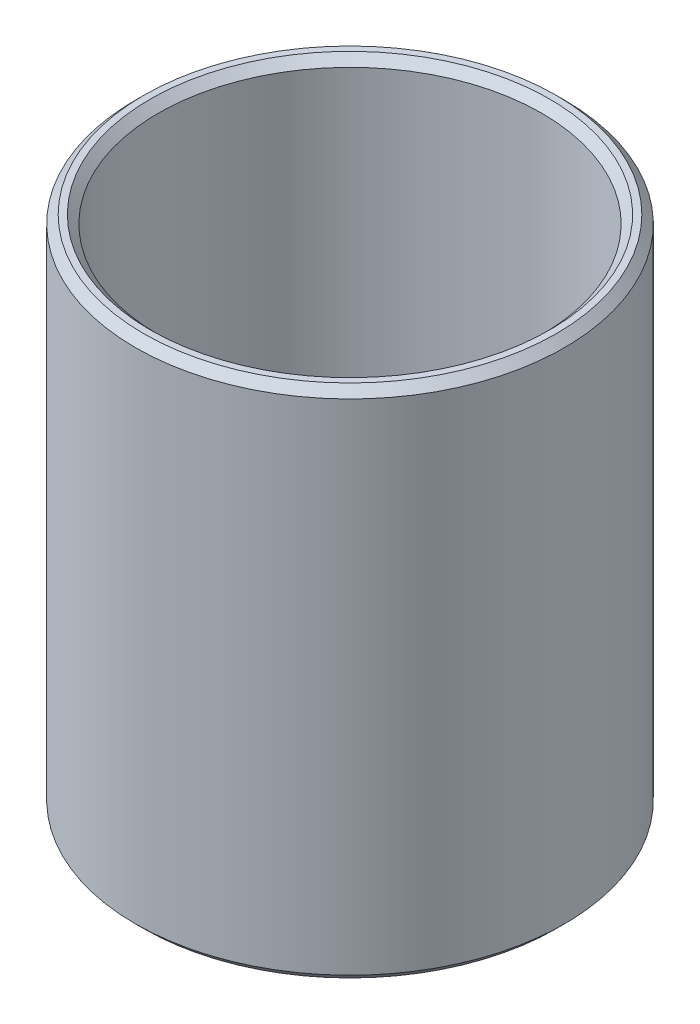
ISO-10303-21;
HEADER;
FILE_DESCRIPTION(('STEP AP214'),'2;1');
FILE_NAME('part.step','',(''),(''),'','','');
FILE_SCHEMA(('AUTOMOTIVE_DESIGN { 1 0 10303 214 1 1 1 1 }'));
ENDSEC;
DATA;
#1=APPLICATION_CONTEXT('core data for automotive mechanical design processes');
#2=APPLICATION_PROTOCOL_DEFINITION('international standard','automotive_design',2000,#1);
#3=PRODUCT_CONTEXT('',#1,'mechanical');
#4=PRODUCT('Part','Part','',(#3));
#5=PRODUCT_RELATED_PRODUCT_CATEGORY('part','',(#4));
#6=PRODUCT_DEFINITION_FORMATION('','',#4);
#7=PRODUCT_DEFINITION_CONTEXT('part definition',#1,'design');
#8=PRODUCT_DEFINITION('design','',#6,#7);
#9=PRODUCT_DEFINITION_SHAPE('','',#8);
#10=(LENGTH_UNIT() NAMED_UNIT(*) SI_UNIT(.MILLI.,.METRE.));
#11=(NAMED_UNIT(*) PLANE_ANGLE_UNIT() SI_UNIT($,.RADIAN.));
#12=(NAMED_UNIT(*) SI_UNIT($,.STERADIAN.) SOLID_ANGLE_UNIT());
#13=UNCERTAINTY_MEASURE_WITH_UNIT(LENGTH_MEASURE(1.E-05),#10,'distance_accuracy_value','');
#14=(GEOMETRIC_REPRESENTATION_CONTEXT(3) GLOBAL_UNCERTAINTY_ASSIGNED_CONTEXT((#13)) GLOBAL_UNIT_ASSIGNED_CONTEXT((#10,
#11,#12)) REPRESENTATION_CONTEXT('',''));
#15=CARTESIAN_POINT('',(0.,0.,0.));
#16=DIRECTION('',(0.,0.,1.));
#17=DIRECTION('',(1.,0.,0.));
#18=AXIS2_PLACEMENT_3D('',#15,#16,#17);
#19=CARTESIAN_POINT('',(0.,102.10385345055,0.));
#20=DIRECTION('',(0.,-1.,0.));
#21=DIRECTION('',(0.,0.,-1.));
#22=AXIS2_PLACEMENT_3D('',#19,#20,#21);
#23=CYLINDRICAL_SURFACE('',#22,42.5);
#24=CARTESIAN_POINT('',(0.,1.60744436866984,0.));
#25=DIRECTION('',(0.,1.,0.));
#26=DIRECTION('',(0.,0.,1.));
#27=AXIS2_PLACEMENT_3D('',#24,#25,#26);
#28=CIRCLE('',#27,42.5);
#29=CARTESIAN_POINT('',(0.,1.60744436866984,42.5));
#30=VERTEX_POINT('',#29);
#31=EDGE_CURVE('E10',#30,#30,#28,.T.);
#32=ORIENTED_EDGE('',*,*,#31,.T.);
#33=EDGE_LOOP('',(#32));
#34=FACE_BOUND('',#33,.T.);
#35=CARTESIAN_POINT('',(0.,100.496409081881,0.));
#36=DIRECTION('',(0.,1.,0.));
#37=DIRECTION('',(0.,0.,1.));
#38=AXIS2_PLACEMENT_3D('',#35,#36,#37);
#39=CIRCLE('',#38,42.5);
#40=CARTESIAN_POINT('',(0.,100.496409081881,42.5));
#41=VERTEX_POINT('',#40);
#42=EDGE_CURVE('E50',#41,#41,#39,.F.);
#43=ORIENTED_EDGE('',*,*,#42,.T.);
#44=EDGE_LOOP('',(#43));
#45=FACE_BOUND('',#44,.T.);
#46=ADVANCED_FACE('F39',(#34,#45),#23,.T.);
#47=CARTESIAN_POINT('',(0.,102.10385345055,0.));
#48=DIRECTION('',(0.,1.,0.));
#49=DIRECTION('',(0.,0.,1.));
#50=AXIS2_PLACEMENT_3D('',#47,#48,#49);
#51=PLANE('',#50);
#52=CARTESIAN_POINT('',(0.,102.10385345055,0.));
#53=DIRECTION('',(0.,1.,0.));
#54=DIRECTION('',(0.,0.,1.));
#55=AXIS2_PLACEMENT_3D('',#52,#53,#54);
#56=CIRCLE('',#55,39.6003826100809);
#57=CARTESIAN_POINT('',(0.,102.10385345055,39.6003826100809));
#58=VERTEX_POINT('',#57);
#59=EDGE_CURVE('E58',#58,#58,#56,.F.);
#60=ORIENTED_EDGE('',*,*,#59,.T.);
#61=EDGE_LOOP('',(#60));
#62=FACE_BOUND('',#61,.T.);
#63=CARTESIAN_POINT('',(0.,102.10385345055,0.));
#64=DIRECTION('',(0.,1.,0.));
#65=DIRECTION('',(0.,0.,1.));
#66=AXIS2_PLACEMENT_3D('',#63,#64,#65);
#67=CIRCLE('',#66,40.8925556313302);
#68=CARTESIAN_POINT('',(0.,102.10385345055,40.8925556313302));
#69=VERTEX_POINT('',#68);
#70=EDGE_CURVE('E61',#69,#69,#67,.T.);
#71=ORIENTED_EDGE('',*,*,#70,.T.);
#72=EDGE_LOOP('',(#71));
#73=FACE_BOUND('',#72,.T.);
#74=ADVANCED_FACE('F88',(#62,#73),#51,.T.);
#75=CARTESIAN_POINT('',(0.,0.,0.));
#76=DIRECTION('',(0.,1.,0.));
#77=DIRECTION('',(0.,0.,1.));
#78=AXIS2_PLACEMENT_3D('',#75,#76,#77);
#79=PLANE('',#78);
#80=CARTESIAN_POINT('',(0.,0.,0.));
#81=DIRECTION('',(0.,1.,0.));
#82=DIRECTION('',(0.,0.,1.));
#83=AXIS2_PLACEMENT_3D('',#80,#81,#82);
#84=CIRCLE('',#83,39.6003826100809);
#85=CARTESIAN_POINT('',(0.,0.,-39.6003826100809));
#86=VERTEX_POINT('',#85);
#87=EDGE_CURVE('E51',#86,#86,#84,.T.);
#88=ORIENTED_EDGE('',*,*,#87,.T.);
#89=EDGE_LOOP('',(#88));
#90=FACE_BOUND('',#89,.T.);
#91=CARTESIAN_POINT('',(0.,0.,0.));
#92=DIRECTION('',(0.,1.,0.));
#93=DIRECTION('',(0.,0.,1.));
#94=AXIS2_PLACEMENT_3D('',#91,#92,#93);
#95=CIRCLE('',#94,40.8925556313302);
#96=CARTESIAN_POINT('',(0.,0.,40.8925556313302));
#97=VERTEX_POINT('',#96);
#98=EDGE_CURVE('E54',#97,#97,#95,.F.);
#99=ORIENTED_EDGE('',*,*,#98,.T.);
#100=EDGE_LOOP('',(#99));
#101=FACE_BOUND('',#100,.T.);
#102=ADVANCED_FACE('F83',(#90,#101),#79,.F.);
#103=CARTESIAN_POINT('',(0.,102.10385345055,0.));
#104=DIRECTION('',(0.,-1.,0.));
#105=DIRECTION('',(0.,0.,-1.));
#106=AXIS2_PLACEMENT_3D('',#103,#104,#105);
#107=CYLINDRICAL_SURFACE('',#106,37.9929382414111);
#108=CARTESIAN_POINT('',(0.,100.496409081881,0.));
#109=DIRECTION('',(0.,1.,0.));
#110=DIRECTION('',(0.,0.,1.));
#111=AXIS2_PLACEMENT_3D('',#108,#109,#110);
#112=CIRCLE('',#111,37.9929382414111);
#113=CARTESIAN_POINT('',(0.,100.496409081881,-37.9929382414111));
#114=VERTEX_POINT('',#113);
#115=EDGE_CURVE('E67',#114,#114,#112,.T.);
#116=CARTESIAN_POINT('',(0.,1.60744436866984,0.));
#117=DIRECTION('',(0.,1.,0.));
#118=DIRECTION('',(0.,0.,1.));
#119=AXIS2_PLACEMENT_3D('',#116,#117,#118);
#120=CIRCLE('',#119,37.9929382414111);
#121=CARTESIAN_POINT('',(0.,1.60744436866984,-37.9929382414111));
#122=VERTEX_POINT('',#121);
#123=EDGE_CURVE('E69',#122,#122,#120,.F.);
#124=CARTESIAN_POINT('',(0.,100.496409081881,-37.9929382414111));
#125=CARTESIAN_POINT('',(0.,99.4663156994513,-37.9929382414111));
#126=CARTESIAN_POINT('',(0.,98.436222317022,-37.9929382414111));
#127=CARTESIAN_POINT('',(0.,96.3760355521634,-37.9929382414111));
#128=CARTESIAN_POINT('',(0.,95.3459421697341,-37.9929382414111));
#129=CARTESIAN_POINT('',(0.,93.2857554048756,-37.9929382414111));
#130=CARTESIAN_POINT('',(0.,92.2556620224463,-37.9929382414111));
#131=CARTESIAN_POINT('',(0.,90.1954752575878,-37.9929382414111));
#132=CARTESIAN_POINT('',(0.,89.1653818751585,-37.9929382414111));
#133=CARTESIAN_POINT('',(0.,87.1051951102999,-37.9929382414111));
#134=CARTESIAN_POINT('',(0.,86.0751017278706,-37.9929382414111));
#135=CARTESIAN_POINT('',(0.,84.0149149630121,-37.9929382414111));
#136=CARTESIAN_POINT('',(0.,82.9848215805828,-37.9929382414111));
#137=CARTESIAN_POINT('',(0.,80.9246348157242,-37.9929382414111));
#138=CARTESIAN_POINT('',(0.,79.894541433295,-37.9929382414111));
#139=CARTESIAN_POINT('',(0.,77.8343546684364,-37.9929382414111));
#140=CARTESIAN_POINT('',(0.,76.8042612860071,-37.9929382414111));
#141=CARTESIAN_POINT('',(0.,74.7440745211486,-37.9929382414111));
#142=CARTESIAN_POINT('',(0.,73.7139811387193,-37.9929382414111));
#143=CARTESIAN_POINT('',(0.,71.6537943738607,-37.9929382414111));
#144=CARTESIAN_POINT('',(0.,70.6237009914315,-37.9929382414111));
#145=CARTESIAN_POINT('',(0.,68.5635142265729,-37.9929382414111));
#146=CARTESIAN_POINT('',(0.,67.5334208441436,-37.9929382414111));
#147=CARTESIAN_POINT('',(0.,65.4732340792851,-37.9929382414111));
#148=CARTESIAN_POINT('',(0.,64.4431406968558,-37.9929382414111));
#149=CARTESIAN_POINT('',(0.,62.3829539319972,-37.9929382414111));
#150=CARTESIAN_POINT('',(0.,61.352860549568,-37.9929382414111));
#151=CARTESIAN_POINT('',(0.,59.2926737847094,-37.9929382414111));
#152=CARTESIAN_POINT('',(0.,58.2625804022801,-37.9929382414111));
#153=CARTESIAN_POINT('',(0.,56.2023936374216,-37.9929382414111));
#154=CARTESIAN_POINT('',(0.,55.1723002549923,-37.9929382414111));
#155=CARTESIAN_POINT('',(0.,53.1121134901338,-37.9929382414111));
#156=CARTESIAN_POINT('',(0.,52.0820201077045,-37.9929382414111));
#157=CARTESIAN_POINT('',(0.,50.0218333428459,-37.9929382414111));
#158=CARTESIAN_POINT('',(0.,48.9917399604166,-37.9929382414111));
#159=CARTESIAN_POINT('',(0.,46.9315531955581,-37.9929382414111));
#160=CARTESIAN_POINT('',(0.,45.9014598131288,-37.9929382414111));
#161=CARTESIAN_POINT('',(0.,43.8412730482702,-37.9929382414111));
#162=CARTESIAN_POINT('',(0.,42.811179665841,-37.9929382414111));
#163=CARTESIAN_POINT('',(0.,40.7509929009824,-37.9929382414111));
#164=CARTESIAN_POINT('',(0.,39.7208995185531,-37.9929382414111));
#165=CARTESIAN_POINT('',(0.,37.6607127536946,-37.9929382414111));
#166=CARTESIAN_POINT('',(0.,36.6306193712653,-37.9929382414111));
#167=CARTESIAN_POINT('',(0.,34.5704326064067,-37.9929382414111));
#168=CARTESIAN_POINT('',(0.,33.5403392239775,-37.9929382414111));
#169=CARTESIAN_POINT('',(0.,31.4801524591189,-37.9929382414111));
#170=CARTESIAN_POINT('',(0.,30.4500590766896,-37.9929382414111));
#171=CARTESIAN_POINT('',(0.,28.3898723118311,-37.9929382414111));
#172=CARTESIAN_POINT('',(0.,27.3597789294018,-37.9929382414111));
#173=CARTESIAN_POINT('',(0.,25.2995921645432,-37.9929382414111));
#174=CARTESIAN_POINT('',(0.,24.269498782114,-37.9929382414111));
#175=CARTESIAN_POINT('',(0.,22.2093120172554,-37.9929382414111));
#176=CARTESIAN_POINT('',(0.,21.1792186348261,-37.9929382414111));
#177=CARTESIAN_POINT('',(0.,19.1190318699676,-37.9929382414111));
#178=CARTESIAN_POINT('',(0.,18.0889384875383,-37.9929382414111));
#179=CARTESIAN_POINT('',(0.,16.0287517226797,-37.9929382414111));
#180=CARTESIAN_POINT('',(0.,14.9986583402505,-37.9929382414111));
#181=CARTESIAN_POINT('',(0.,12.9384715753919,-37.9929382414111));
#182=CARTESIAN_POINT('',(0.,11.9083781929626,-37.9929382414111));
#183=CARTESIAN_POINT('',(0.,9.84819142810408,-37.9929382414111));
#184=CARTESIAN_POINT('',(0.,8.8180980456748,-37.9929382414111));
#185=CARTESIAN_POINT('',(0.,6.75791128081624,-37.9929382414111));
#186=CARTESIAN_POINT('',(0.,5.72781789838697,-37.9929382414111));
#187=CARTESIAN_POINT('',(0.,3.66763113352841,-37.9929382414111));
#188=CARTESIAN_POINT('',(0.,2.63753775109913,-37.9929382414111));
#189=CARTESIAN_POINT('',(0.,1.60744436866984,-37.9929382414111));
#190=B_SPLINE_CURVE_WITH_KNOTS('',3,(#124,#125,#126,#127,#128,#129,#130,#131,#132,#133,#134,
#135,#136,#137,#138,#139,#140,#141,#142,#143,#144,#145,#146,#147,#148,#149,#150,#151,#152,#153,
#154,#155,#156,#157,#158,#159,#160,#161,#162,#163,#164,#165,#166,#167,#168,#169,#170,#171,#172,
#173,#174,#175,#176,#177,#178,#179,#180,#181,#182,#183,#184,#185,#186,#187,#188,#189),
.UNSPECIFIED.,.F.,.F.,(4,2,2,2,2,2,2,2,2,2,2,2,2,2,2,2,2,2,2,2,2,2,2,2,2,2,2,2,2,2,2,2,4),(0.,
3.09028014728784,6.18056029457567,9.27084044186351,12.3611205891513,15.4514007364392,
18.541680883727,21.6319610310148,24.7222411783027,27.8125213255905,30.9028014728783,
33.9930816201662,37.083361767454,40.1736419147419,43.2639220620297,46.3542022093175,
49.4444823566053,52.5347625038932,55.625042651181,58.7153227984688,61.8056029457567,
64.8958830930445,67.9861632403323,71.0764433876202,74.166723534908,77.2570036821959,
80.3472838294837,83.4375639767715,86.5278441240594,89.6181242713472,92.708404418635,
95.7986845659228,98.8889647132107),.UNSPECIFIED.);
#191=EDGE_CURVE('BSEAM71',#114,#122,#190,.T.);
#192=ORIENTED_EDGE('',*,*,#115,.T.);
#193=ORIENTED_EDGE('',*,*,#123,.T.);
#194=ORIENTED_EDGE('',*,*,#191,.T.);
#195=ORIENTED_EDGE('',*,*,#191,.F.);
#196=EDGE_LOOP('',(#192,#194,#193,#195));
#197=FACE_BOUND('',#196,.T.);
#198=ADVANCED_FACE('F71',(#197),#107,.F.);
#199=CARTESIAN_POINT('',(0.,100.496409081881,0.));
#200=DIRECTION('',(0.,1.,0.));
#201=DIRECTION('',(0.,0.,1.));
#202=AXIS2_PLACEMENT_3D('',#199,#200,#201);
#203=CONICAL_SURFACE('',#202,37.9929382414111,0.78539816339745);
#204=ORIENTED_EDGE('',*,*,#59,.F.);
#205=EDGE_LOOP('',(#204));
#206=FACE_BOUND('',#205,.T.);
#207=ORIENTED_EDGE('',*,*,#115,.F.);
#208=EDGE_LOOP('',(#207));
#209=FACE_BOUND('',#208,.T.);
#210=ADVANCED_FACE('F77',(#206,#209),#203,.F.);
#211=CARTESIAN_POINT('',(0.,0.,0.));
#212=DIRECTION('',(0.,-1.,0.));
#213=DIRECTION('',(0.,0.,-1.));
#214=AXIS2_PLACEMENT_3D('',#211,#212,#213);
#215=CONICAL_SURFACE('',#214,39.6003826100809,0.785398163397446);
#216=CARTESIAN_POINT('',(0.,1.60744436866984,-37.9929382414111));
#217=CARTESIAN_POINT('',(0.,1.5907001564962,-38.0096824535848));
#218=CARTESIAN_POINT('',(0.,1.57395594432255,-38.0264266657584));
#219=CARTESIAN_POINT('',(0.,1.54046751997527,-38.0599150901057));
#220=CARTESIAN_POINT('',(0.,1.52372330780162,-38.0766593022793));
#221=CARTESIAN_POINT('',(0.,1.49023488345434,-38.1101477266266));
#222=CARTESIAN_POINT('',(0.,1.47349067128069,-38.1268919388003));
#223=CARTESIAN_POINT('',(0.,1.4400022469334,-38.1603803631476));
#224=CARTESIAN_POINT('',(0.,1.42325803475976,-38.1771245753212));
#225=CARTESIAN_POINT('',(0.,1.38976961041247,-38.2106129996685));
#226=CARTESIAN_POINT('',(0.,1.37302539823882,-38.2273572118421));
#227=CARTESIAN_POINT('',(0.,1.33953697389154,-38.2608456361894));
#228=CARTESIAN_POINT('',(0.,1.32279276171789,-38.2775898483631));
#229=CARTESIAN_POINT('',(0.,1.2893043373706,-38.3110782727104));
#230=CARTESIAN_POINT('',(0.,1.27256012519696,-38.327822484884));
#231=CARTESIAN_POINT('',(0.,1.23907170084967,-38.3613109092313));
#232=CARTESIAN_POINT('',(0.,1.22232748867603,-38.3780551214049));
#233=CARTESIAN_POINT('',(0.,1.18883906432874,-38.4115435457522));
#234=CARTESIAN_POINT('',(0.,1.17209485215509,-38.4282877579259));
#235=CARTESIAN_POINT('',(0.,1.13860642780781,-38.4617761822731));
#236=CARTESIAN_POINT('',(0.,1.12186221563416,-38.4785203944468));
#237=CARTESIAN_POINT('',(0.,1.08837379128687,-38.5120088187941));
#238=CARTESIAN_POINT('',(0.,1.07162957911323,-38.5287530309677));
#239=CARTESIAN_POINT('',(0.,1.03814115476594,-38.562241455315));
#240=CARTESIAN_POINT('',(0.,1.0213969425923,-38.5789856674887));
#241=CARTESIAN_POINT('',(0.,0.987908518245008,-38.6124740918359));
#242=CARTESIAN_POINT('',(0.,0.971164306071364,-38.6292183040096));
#243=CARTESIAN_POINT('',(0.,0.937675881724076,-38.6627067283569));
#244=CARTESIAN_POINT('',(0.,0.920931669550432,-38.6794509405305));
#245=CARTESIAN_POINT('',(0.,0.887443245203143,-38.7129393648778));
#246=CARTESIAN_POINT('',(0.,0.870699033029498,-38.7296835770514));
#247=CARTESIAN_POINT('',(0.,0.83721060868221,-38.7631720013987));
#248=CARTESIAN_POINT('',(0.,0.820466396508567,-38.7799162135724));
#249=CARTESIAN_POINT('',(0.,0.786977972161279,-38.8134046379197));
#250=CARTESIAN_POINT('',(0.,0.770233759987634,-38.8301488500933));
#251=CARTESIAN_POINT('',(0.,0.736745335640345,-38.8636372744406));
#252=CARTESIAN_POINT('',(0.,0.720001123466701,-38.8803814866142));
#253=CARTESIAN_POINT('',(0.,0.686512699119412,-38.9138699109615));
#254=CARTESIAN_POINT('',(0.,0.669768486945768,-38.9306141231352));
#255=CARTESIAN_POINT('',(0.,0.636280062598479,-38.9641025474825));
#256=CARTESIAN_POINT('',(0.,0.619535850424836,-38.9808467596561));
#257=CARTESIAN_POINT('',(0.,0.586047426077548,-39.0143351840034));
#258=CARTESIAN_POINT('',(0.,0.569303213903903,-39.031079396177));
#259=CARTESIAN_POINT('',(0.,0.535814789556614,-39.0645678205243));
#260=CARTESIAN_POINT('',(0.,0.519070577382971,-39.081312032698));
#261=CARTESIAN_POINT('',(0.,0.485582153035682,-39.1148004570453));
#262=CARTESIAN_POINT('',(0.,0.468837940862037,-39.1315446692189));
#263=CARTESIAN_POINT('',(0.,0.435349516514749,-39.1650330935662));
#264=CARTESIAN_POINT('',(0.,0.418605304341106,-39.1817773057398));
#265=CARTESIAN_POINT('',(0.,0.385116879993818,-39.2152657300871));
#266=CARTESIAN_POINT('',(0.,0.368372667820173,-39.2320099422608));
#267=CARTESIAN_POINT('',(0.,0.334884243472884,-39.2654983666081));
#268=CARTESIAN_POINT('',(0.,0.318140031299239,-39.2822425787817));
#269=CARTESIAN_POINT('',(0.,0.284651606951951,-39.315731003129));
#270=CARTESIAN_POINT('',(0.,0.267907394778308,-39.3324752153026));
#271=CARTESIAN_POINT('',(0.,0.23441897043102,-39.3659636396499));
#272=CARTESIAN_POINT('',(0.,0.217674758257375,-39.3827078518236));
#273=CARTESIAN_POINT('',(0.,0.184186333910086,-39.4161962761709));
#274=CARTESIAN_POINT('',(0.,0.167442121736442,-39.4329404883445));
#275=CARTESIAN_POINT('',(0.,0.133953697389154,-39.4664289126918));
#276=CARTESIAN_POINT('',(0.,0.117209485215509,-39.4831731248654));
#277=CARTESIAN_POINT('',(0.,0.0837210608682205,-39.5166615492127));
#278=CARTESIAN_POINT('',(0.,0.0669768486945768,-39.5334057613864));
#279=CARTESIAN_POINT('',(0.,0.0334884243472896,-39.5668941857337));
#280=CARTESIAN_POINT('',(0.,0.0167442121736459,-39.5836383979073));
#281=CARTESIAN_POINT('',(0.,0.,-39.6003826100809));
#282=B_SPLINE_CURVE_WITH_KNOTS('',3,(#216,#217,#218,#219,#220,#221,#222,#223,#224,#225,#226,
#227,#228,#229,#230,#231,#232,#233,#234,#235,#236,#237,#238,#239,#240,#241,#242,#243,#244,#245,
#246,#247,#248,#249,#250,#251,#252,#253,#254,#255,#256,#257,#258,#259,#260,#261,#262,#263,#264,
#265,#266,#267,#268,#269,#270,#271,#272,#273,#274,#275,#276,#277,#278,#279,#280,#281),
.UNSPECIFIED.,.F.,.F.,(4,2,2,2,2,2,2,2,2,2,2,2,2,2,2,2,2,2,2,2,2,2,2,2,2,2,2,2,2,2,2,2,4),(0.,
0.0710396758416594,0.142079351683324,0.213119027524983,0.284158703366643,0.355198379208302,
0.426238055049966,0.497277730891626,0.568317406733285,0.63935708257495,0.710396758416609,
0.781436434258269,0.852476110099928,0.923515785941592,0.994555461783252,1.06559513762491,
1.13663481346658,1.20767448930824,1.27871416514989,1.34975384099155,1.42079351683322,
1.49183319267488,1.56287286851654,1.6339125443582,1.70495222019986,1.77599189604152,
1.84703157188318,1.91807124772484,1.9891109235665,2.06015059940816,2.13119027524982,
2.20222995109149,2.27326962693315),.UNSPECIFIED.);
#283=EDGE_CURVE('BSEAM73',#122,#86,#282,.T.);
#284=ORIENTED_EDGE('',*,*,#123,.F.);
#285=ORIENTED_EDGE('',*,*,#87,.F.);
#286=ORIENTED_EDGE('',*,*,#283,.T.);
#287=ORIENTED_EDGE('',*,*,#283,.F.);
#288=EDGE_LOOP('',(#284,#286,#285,#287));
#289=FACE_BOUND('',#288,.T.);
#290=ADVANCED_FACE('F73',(#289),#215,.F.);
#291=CARTESIAN_POINT('',(0.,1.60744436866984,0.));
#292=DIRECTION('',(0.,1.,0.));
#293=DIRECTION('',(0.,0.,1.));
#294=AXIS2_PLACEMENT_3D('',#291,#292,#293);
#295=CONICAL_SURFACE('',#294,42.5,0.785398163397448);
#296=CARTESIAN_POINT('',(0.,0.,40.8925556313302));
#297=CARTESIAN_POINT('',(0.,0.0167442121736456,40.9092998435038));
#298=CARTESIAN_POINT('',(0.,0.0334884243472893,40.9260440556775));
#299=CARTESIAN_POINT('',(0.,0.0669768486945767,40.9595324800247));
#300=CARTESIAN_POINT('',(0.,0.0837210608682204,40.9762766921984));
#301=CARTESIAN_POINT('',(0.,0.117209485215509,41.0097651165457));
#302=CARTESIAN_POINT('',(0.,0.133953697389153,41.0265093287193));
#303=CARTESIAN_POINT('',(0.,0.167442121736442,41.0599977530666));
#304=CARTESIAN_POINT('',(0.,0.184186333910087,41.0767419652402));
#305=CARTESIAN_POINT('',(0.,0.217674758257375,41.1102303895875));
#306=CARTESIAN_POINT('',(0.,0.234418970431018,41.1269746017612));
#307=CARTESIAN_POINT('',(0.,0.267907394778306,41.1604630261085));
#308=CARTESIAN_POINT('',(0.,0.284651606951951,41.1772072382821));
#309=CARTESIAN_POINT('',(0.,0.31814003129924,41.2106956626294));
#310=CARTESIAN_POINT('',(0.,0.334884243472884,41.227439874803));
#311=CARTESIAN_POINT('',(0.,0.368372667820173,41.2609282991503));
#312=CARTESIAN_POINT('',(0.,0.385116879993817,41.277672511324));
#313=CARTESIAN_POINT('',(0.,0.418605304341105,41.3111609356713));
#314=CARTESIAN_POINT('',(0.,0.435349516514749,41.3279051478449));
#315=CARTESIAN_POINT('',(0.,0.468837940862037,41.3613935721922));
#316=CARTESIAN_POINT('',(0.,0.485582153035681,41.3781377843658));
#317=CARTESIAN_POINT('',(0.,0.519070577382971,41.4116262087131));
#318=CARTESIAN_POINT('',(0.,0.535814789556615,41.4283704208868));
#319=CARTESIAN_POINT('',(0.,0.569303213903903,41.4618588452341));
#320=CARTESIAN_POINT('',(0.,0.586047426077547,41.4786030574077));
#321=CARTESIAN_POINT('',(0.,0.619535850424835,41.512091481755));
#322=CARTESIAN_POINT('',(0.,0.636280062598479,41.5288356939286));
#323=CARTESIAN_POINT('',(0.,0.669768486945769,41.5623241182759));
#324=CARTESIAN_POINT('',(0.,0.686512699119413,41.5790683304496));
#325=CARTESIAN_POINT('',(0.,0.720001123466701,41.6125567547969));
#326=CARTESIAN_POINT('',(0.,0.736745335640345,41.6293009669705));
#327=CARTESIAN_POINT('',(0.,0.770233759987633,41.6627893913178));
#328=CARTESIAN_POINT('',(0.,0.786977972161277,41.6795336034914));
#329=CARTESIAN_POINT('',(0.,0.820466396508567,41.7130220278387));
#330=CARTESIAN_POINT('',(0.,0.837210608682211,41.7297662400124));
#331=CARTESIAN_POINT('',(0.,0.870699033029499,41.7632546643597));
#332=CARTESIAN_POINT('',(0.,0.887443245203143,41.7799988765333));
#333=CARTESIAN_POINT('',(0.,0.920931669550431,41.8134873008806));
#334=CARTESIAN_POINT('',(0.,0.937675881724075,41.8302315130542));
#335=CARTESIAN_POINT('',(0.,0.971164306071365,41.8637199374015));
#336=CARTESIAN_POINT('',(0.,0.987908518245009,41.8804641495752));
#337=CARTESIAN_POINT('',(0.,1.0213969425923,41.9139525739225));
#338=CARTESIAN_POINT('',(0.,1.03814115476594,41.9306967860961));
#339=CARTESIAN_POINT('',(0.,1.07162957911323,41.9641852104434));
#340=CARTESIAN_POINT('',(0.,1.08837379128687,41.980929422617));
#341=CARTESIAN_POINT('',(0.,1.12186221563416,42.0144178469643));
#342=CARTESIAN_POINT('',(0.,1.13860642780781,42.031162059138));
#343=CARTESIAN_POINT('',(0.,1.17209485215509,42.0646504834853));
#344=CARTESIAN_POINT('',(0.,1.18883906432874,42.0813946956589));
#345=CARTESIAN_POINT('',(0.,1.22232748867603,42.1148831200062));
#346=CARTESIAN_POINT('',(0.,1.23907170084967,42.1316273321798));
#347=CARTESIAN_POINT('',(0.,1.27256012519696,42.1651157565271));
#348=CARTESIAN_POINT('',(0.,1.2893043373706,42.1818599687008));
#349=CARTESIAN_POINT('',(0.,1.32279276171789,42.2153483930481));
#350=CARTESIAN_POINT('',(0.,1.33953697389154,42.2320926052217));
#351=CARTESIAN_POINT('',(0.,1.37302539823883,42.265581029569));
#352=CARTESIAN_POINT('',(0.,1.38976961041247,42.2823252417426));
#353=CARTESIAN_POINT('',(0.,1.42325803475976,42.3158136660899));
#354=CARTESIAN_POINT('',(0.,1.4400022469334,42.3325578782636));
#355=CARTESIAN_POINT('',(0.,1.47349067128069,42.3660463026109));
#356=CARTESIAN_POINT('',(0.,1.49023488345434,42.3827905147845));
#357=CARTESIAN_POINT('',(0.,1.52372330780162,42.4162789391318));
#358=CARTESIAN_POINT('',(0.,1.54046751997527,42.4330231513054));
#359=CARTESIAN_POINT('',(0.,1.57395594432255,42.4665115756527));
#360=CARTESIAN_POINT('',(0.,1.5907001564962,42.4832557878264));
#361=CARTESIAN_POINT('',(0.,1.60744436866984,42.5));
#362=B_SPLINE_CURVE_WITH_KNOTS('',3,(#296,#297,#298,#299,#300,#301,#302,#303,#304,#305,#306,
#307,#308,#309,#310,#311,#312,#313,#314,#315,#316,#317,#318,#319,#320,#321,#322,#323,#324,#325,
#326,#327,#328,#329,#330,#331,#332,#333,#334,#335,#336,#337,#338,#339,#340,#341,#342,#343,#344,
#345,#346,#347,#348,#349,#350,#351,#352,#353,#354,#355,#356,#357,#358,#359,#360,#361),
.UNSPECIFIED.,.F.,.F.,(4,2,2,2,2,2,2,2,2,2,2,2,2,2,2,2,2,2,2,2,2,2,2,2,2,2,2,2,2,2,2,2,4),(0.,
0.0710396758416594,0.142079351683324,0.213119027524983,0.284158703366643,0.355198379208307,
0.426238055049966,0.497277730891626,0.568317406733285,0.63935708257495,0.710396758416609,
0.781436434258269,0.852476110099933,0.923515785941592,0.994555461783252,1.06559513762492,
1.13663481346658,1.20767448930824,1.2787141651499,1.34975384099156,1.42079351683322,
1.49183319267488,1.56287286851654,1.6339125443582,1.70495222019987,1.77599189604153,
1.84703157188318,1.91807124772484,1.98911092356651,2.06015059940817,2.13119027524983,
2.20222995109149,2.27326962693315),.UNSPECIFIED.);
#363=EDGE_CURVE('BSEAM76',#97,#30,#362,.T.);
#364=ORIENTED_EDGE('',*,*,#98,.F.);
#365=ORIENTED_EDGE('',*,*,#31,.F.);
#366=ORIENTED_EDGE('',*,*,#363,.T.);
#367=ORIENTED_EDGE('',*,*,#363,.F.);
#368=EDGE_LOOP('',(#364,#366,#365,#367));
#369=FACE_BOUND('',#368,.T.);
#370=ADVANCED_FACE('F76',(#369),#295,.T.);
#371=CARTESIAN_POINT('',(0.,102.10385345055,0.));
#372=DIRECTION('',(0.,-1.,0.));
#373=DIRECTION('',(0.,0.,-1.));
#374=AXIS2_PLACEMENT_3D('',#371,#372,#373);
#375=CONICAL_SURFACE('',#374,40.8925556313302,0.785398163397444);
#376=ORIENTED_EDGE('',*,*,#42,.F.);
#377=EDGE_LOOP('',(#376));
#378=FACE_BOUND('',#377,.T.);
#379=ORIENTED_EDGE('',*,*,#70,.F.);
#380=EDGE_LOOP('',(#379));
#381=FACE_BOUND('',#380,.T.);
#382=ADVANCED_FACE('F45',(#378,#381),#375,.T.);
#383=CLOSED_SHELL('',(#46,#74,#102,#198,#210,#290,#370,#382));
#384=MANIFOLD_SOLID_BREP('B2',#383);
#385=ADVANCED_BREP_SHAPE_REPRESENTATION('',(#18,#384),#14);
#386=SHAPE_DEFINITION_REPRESENTATION(#9,#385);
ENDSEC;
END-ISO-10303-21;
